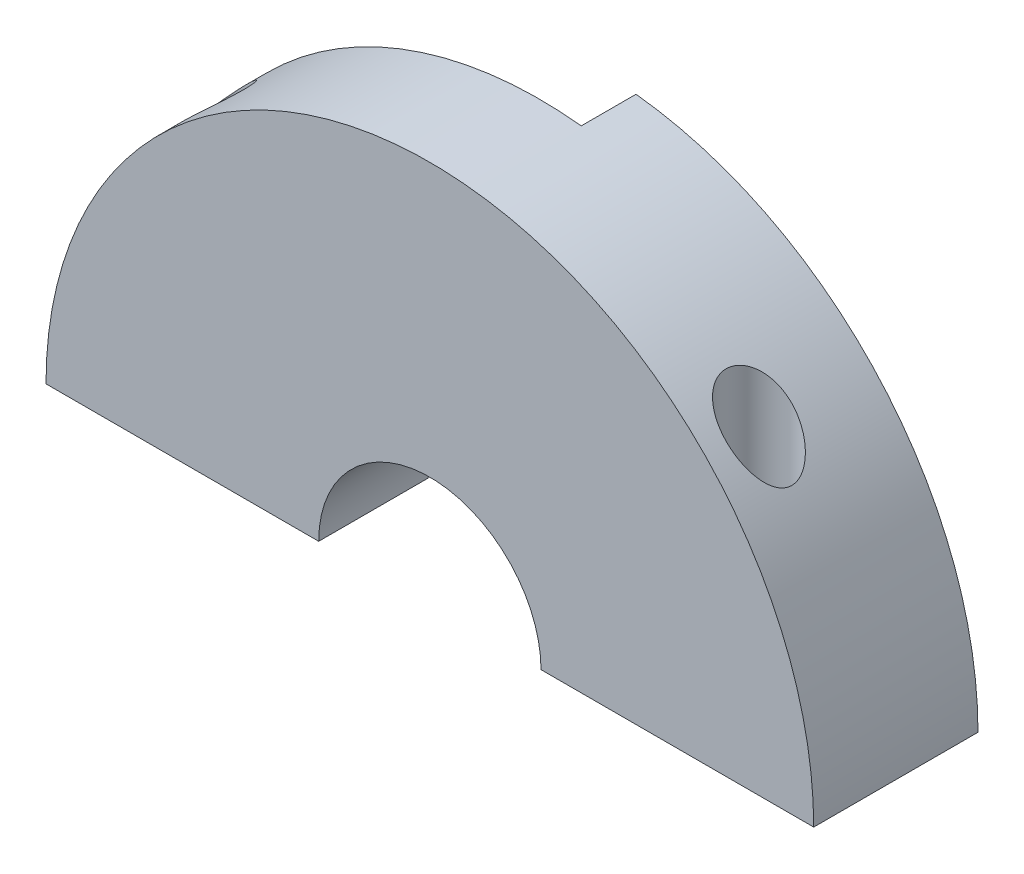
ISO-10303-21;
HEADER;
FILE_DESCRIPTION(('STEP AP214'),'2;1');
FILE_NAME('part.step','',(''),(''),'','','');
FILE_SCHEMA(('AUTOMOTIVE_DESIGN { 1 0 10303 214 1 1 1 1 }'));
ENDSEC;
DATA;
#1=APPLICATION_CONTEXT('core data for automotive mechanical design processes');
#2=APPLICATION_PROTOCOL_DEFINITION('international standard','automotive_design',2000,#1);
#3=PRODUCT_CONTEXT('',#1,'mechanical');
#4=PRODUCT('Part','Part','',(#3));
#5=PRODUCT_RELATED_PRODUCT_CATEGORY('part','',(#4));
#6=PRODUCT_DEFINITION_FORMATION('','',#4);
#7=PRODUCT_DEFINITION_CONTEXT('part definition',#1,'design');
#8=PRODUCT_DEFINITION('design','',#6,#7);
#9=PRODUCT_DEFINITION_SHAPE('','',#8);
#10=(LENGTH_UNIT() NAMED_UNIT(*) SI_UNIT(.MILLI.,.METRE.));
#11=(NAMED_UNIT(*) PLANE_ANGLE_UNIT() SI_UNIT($,.RADIAN.));
#12=(NAMED_UNIT(*) SI_UNIT($,.STERADIAN.) SOLID_ANGLE_UNIT());
#13=UNCERTAINTY_MEASURE_WITH_UNIT(LENGTH_MEASURE(1.E-05),#10,'distance_accuracy_value','');
#14=(GEOMETRIC_REPRESENTATION_CONTEXT(3) GLOBAL_UNCERTAINTY_ASSIGNED_CONTEXT((#13)) GLOBAL_UNIT_ASSIGNED_CONTEXT((#10,
#11,#12)) REPRESENTATION_CONTEXT('',''));
#15=CARTESIAN_POINT('',(0.,0.,0.));
#16=DIRECTION('',(0.,0.,1.));
#17=DIRECTION('',(1.,0.,0.));
#18=AXIS2_PLACEMENT_3D('',#15,#16,#17);
#19=CARTESIAN_POINT('',(0.,0.,-5.));
#20=DIRECTION('',(0.,0.,-1.));
#21=DIRECTION('',(-1.,0.,0.));
#22=AXIS2_PLACEMENT_3D('',#19,#20,#21);
#23=PLANE('',#22);
#24=DIRECTION('',(0.,1.,0.));
#25=VECTOR('',#24,1.);
#26=CARTESIAN_POINT('',(3.825,10.15,-5.));
#27=LINE('',#26,#25);
#28=CARTESIAN_POINT('',(3.825,11.9003939010438,-5.));
#29=VERTEX_POINT('',#28);
#30=CARTESIAN_POINT('',(3.825,34.8406641010185,-5.));
#31=VERTEX_POINT('',#30);
#32=EDGE_CURVE('E256',#29,#31,#27,.T.);
#33=ORIENTED_EDGE('',*,*,#32,.F.);
#34=CARTESIAN_POINT('',(0.,0.,-5.));
#35=DIRECTION('',(0.,0.,-1.));
#36=DIRECTION('',(-1.,0.,0.));
#37=AXIS2_PLACEMENT_3D('',#34,#35,#36);
#38=CIRCLE('',#37,12.5);
#39=CARTESIAN_POINT('',(12.5,0.,-5.));
#40=VERTEX_POINT('',#39);
#41=EDGE_CURVE('E191',#29,#40,#38,.T.);
#42=ORIENTED_EDGE('',*,*,#41,.T.);
#43=DIRECTION('',(1.,0.,0.));
#44=VECTOR('',#43,1.);
#45=CARTESIAN_POINT('',(10.15,0.,-5.));
#46=LINE('',#45,#44);
#47=CARTESIAN_POINT('',(10.15,0.,-5.));
#48=VERTEX_POINT('',#47);
#49=EDGE_CURVE('E175',#48,#40,#46,.T.);
#50=ORIENTED_EDGE('',*,*,#49,.F.);
#51=CARTESIAN_POINT('',(0.,0.,-5.));
#52=DIRECTION('',(0.,0.,-1.));
#53=DIRECTION('',(-1.,0.,0.));
#54=AXIS2_PLACEMENT_3D('',#51,#52,#53);
#55=CIRCLE('',#54,10.15);
#56=CARTESIAN_POINT('',(-10.15,0.,-5.));
#57=VERTEX_POINT('',#56);
#58=EDGE_CURVE('E173',#57,#48,#55,.T.);
#59=ORIENTED_EDGE('',*,*,#58,.F.);
#60=DIRECTION('',(1.,0.,0.));
#61=VECTOR('',#60,1.);
#62=CARTESIAN_POINT('',(-35.05,0.,-5.));
#63=LINE('',#62,#61);
#64=CARTESIAN_POINT('',(-35.05,0.,-5.));
#65=VERTEX_POINT('',#64);
#66=EDGE_CURVE('E79',#65,#57,#63,.T.);
#67=ORIENTED_EDGE('',*,*,#66,.F.);
#68=CARTESIAN_POINT('',(0.,0.,-5.));
#69=DIRECTION('',(0.,0.,1.));
#70=DIRECTION('',(-1.,0.,0.));
#71=AXIS2_PLACEMENT_3D('',#68,#69,#70);
#72=CIRCLE('',#71,35.05);
#73=EDGE_CURVE('E184',#31,#65,#72,.T.);
#74=ORIENTED_EDGE('',*,*,#73,.F.);
#75=EDGE_LOOP('',(#33,#42,#50,#59,#67,#74));
#76=FACE_BOUND('',#75,.T.);
#77=ADVANCED_FACE('F39',(#76),#23,.T.);
#78=CARTESIAN_POINT('',(0.,0.,5.));
#79=DIRECTION('',(0.,0.,-1.));
#80=DIRECTION('',(-1.,0.,0.));
#81=AXIS2_PLACEMENT_3D('',#78,#79,#80);
#82=CYLINDRICAL_SURFACE('',#81,35.05);
#83=CARTESIAN_POINT('',(-25.05,24.5153013442625,-3.));
#84=CARTESIAN_POINT('',(-25.172757891254,24.3898663526324,-3.00000044484929));
#85=CARTESIAN_POINT('',(-25.2945625994032,24.2635156000176,-2.99247561534126));
#86=CARTESIAN_POINT('',(-25.5354877242666,24.0098309185247,-2.96294431357934));
#87=CARTESIAN_POINT('',(-25.6546066663492,23.8824964987061,-2.94093007691785));
#88=CARTESIAN_POINT('',(-25.8895822909666,23.6275717488237,-2.88267004067348));
#89=CARTESIAN_POINT('',(-26.005431624629,23.4999814408841,-2.84639455408118));
#90=CARTESIAN_POINT('',(-26.2328335992969,23.2458595122369,-2.75965769624504));
#91=CARTESIAN_POINT('',(-26.3443879560941,23.1193274849091,-2.70920205808389));
#92=CARTESIAN_POINT('',(-26.5351618997156,22.8998523921002,-2.60822728166251));
#93=CARTESIAN_POINT('',(-26.6154974492892,22.8064147449125,-2.5608727273555));
#94=CARTESIAN_POINT('',(-26.7728837478198,22.6214484357102,-2.45774751161039));
#95=CARTESIAN_POINT('',(-26.8499351951018,22.5299193699943,-2.40197865093966));
#96=CARTESIAN_POINT('',(-27.0000897695027,22.3497509875131,-2.28174986367317));
#97=CARTESIAN_POINT('',(-27.0732010371271,22.2611058755066,-2.21730889989038));
#98=CARTESIAN_POINT('',(-27.2149351571089,22.0876062654062,-2.07914489657723));
#99=CARTESIAN_POINT('',(-27.283560218317,22.0027499084868,-2.00542647804461));
#100=CARTESIAN_POINT('',(-27.4314674780003,21.8182083097646,-1.82891166076218));
#101=CARTESIAN_POINT('',(-27.5092997468093,21.719915638351,-1.72339857306034));
#102=CARTESIAN_POINT('',(-27.6540776902447,21.5352781518383,-1.49563995161742));
#103=CARTESIAN_POINT('',(-27.7210366171384,21.448918812011,-1.37341512586096));
#104=CARTESIAN_POINT('',(-27.8259424466231,21.3125549168893,-1.14285358057722));
#105=CARTESIAN_POINT('',(-27.8669980884483,21.2587951142391,-1.0381847526666));
#106=CARTESIAN_POINT('',(-27.9382255514892,21.1651016240705,-0.819346778024123));
#107=CARTESIAN_POINT('',(-27.9684140166209,21.1251467969754,-0.705192491936466));
#108=CARTESIAN_POINT('',(-28.0116879450171,21.0677224809023,-0.488445951736061));
#109=CARTESIAN_POINT('',(-28.0267410135345,21.0476730341209,-0.386939432738642));
#110=CARTESIAN_POINT('',(-28.0463050481677,21.0215972869105,-0.181145749388428));
#111=CARTESIAN_POINT('',(-28.0508229793721,21.0155617215044,-0.0768604683166422));
#112=CARTESIAN_POINT('',(-28.0489281663807,21.0180905274009,0.131506570301793));
#113=CARTESIAN_POINT('',(-28.0425072108911,21.026665866404,0.23558811619158));
#114=CARTESIAN_POINT('',(-28.0192814263249,21.0576050075944,0.440486055856502));
#115=CARTESIAN_POINT('',(-28.0024689820485,21.0799789217716,0.541299997958127));
#116=CARTESIAN_POINT('',(-27.9543405118352,21.1437767220432,0.761930286264053));
#117=CARTESIAN_POINT('',(-27.9204506240969,21.1885631119406,0.880202822433532));
#118=CARTESIAN_POINT('',(-27.8412377985411,21.2925397959152,1.10607118947644));
#119=CARTESIAN_POINT('',(-27.7958938354049,21.3517565715488,1.21364687332488));
#120=CARTESIAN_POINT('',(-27.6731235877679,21.5108083212011,1.46524579576032));
#121=CARTESIAN_POINT('',(-27.5905930726705,21.6167129315,1.60289654223807));
#122=CARTESIAN_POINT('',(-27.4120550044548,21.8426785160984,1.85601110970815));
#123=CARTESIAN_POINT('',(-27.3160166352573,21.962771756424,1.9714227273624));
#124=CARTESIAN_POINT('',(-27.1373386927273,22.1829350102184,2.15767609782985));
#125=CARTESIAN_POINT('',(-27.0567297040771,22.2812209451849,2.23265472658813));
#126=CARTESIAN_POINT('',(-26.8905690672117,22.4814750781682,2.37150558514877));
#127=CARTESIAN_POINT('',(-26.8050148722535,22.5834451631744,2.43537202313208));
#128=CARTESIAN_POINT('',(-26.6296941242675,22.7899156830797,2.55258506461304));
#129=CARTESIAN_POINT('',(-26.5399241665245,22.8944181290062,2.60592297774579));
#130=CARTESIAN_POINT('',(-26.3568356067813,23.1049601872613,2.70238511156922));
#131=CARTESIAN_POINT('',(-26.2635175754239,23.2109995507214,2.74551096668547));
#132=CARTESIAN_POINT('',(-26.0701167400421,23.4280479107295,2.82323154750622));
#133=CARTESIAN_POINT('',(-25.9699119228552,23.5390902633247,2.85743096318294));
#134=CARTESIAN_POINT('',(-25.7667060073064,23.761357569237,2.91504526035658));
#135=CARTESIAN_POINT('',(-25.6637046862478,23.8725825364298,2.93845928028639));
#136=CARTESIAN_POINT('',(-25.3512257370835,24.2055779349429,2.99231335044384));
#137=CARTESIAN_POINT('',(-25.1380556577606,24.4269133966725,3.00645246376579));
#138=CARTESIAN_POINT('',(-24.822027905311,24.7465170197171,2.99301842739194));
#139=CARTESIAN_POINT('',(-24.7208792551347,24.8475529564468,2.983648890412));
#140=CARTESIAN_POINT('',(-24.518153550358,25.0476136268905,2.95425776847888));
#141=CARTESIAN_POINT('',(-24.4165765022813,25.1466383910979,2.9342363451552));
#142=CARTESIAN_POINT('',(-24.1123880854785,25.4396126273706,2.85737174682403));
#143=CARTESIAN_POINT('',(-23.9099389699068,25.6298463115961,2.78371647760887));
#144=CARTESIAN_POINT('',(-23.5656018323095,25.9461911629145,2.61216007064956));
#145=CARTESIAN_POINT('',(-23.4216123041758,26.076146410766,2.52548416767023));
#146=CARTESIAN_POINT('',(-23.1435495745059,26.3232400341172,2.32270309053491));
#147=CARTESIAN_POINT('',(-23.0094633145827,26.440395388894,2.20663759767674));
#148=CARTESIAN_POINT('',(-22.7841621943713,26.6345986832324,1.97146867589776));
#149=CARTESIAN_POINT('',(-22.68984034258,26.7149142244425,1.85805477353272));
#150=CARTESIAN_POINT('',(-22.5157912520378,26.8617679443251,1.61255872624921));
#151=CARTESIAN_POINT('',(-22.4360483213487,26.9283209464671,1.48049692759225));
#152=CARTESIAN_POINT('',(-22.3064990722413,27.0356913859002,1.22103351295826));
#153=CARTESIAN_POINT('',(-22.2539850297082,27.0788827369731,1.09597308440249));
#154=CARTESIAN_POINT('',(-22.165641317568,27.1512453763183,0.836216138957166));
#155=CARTESIAN_POINT('',(-22.1298044340749,27.1804227266742,0.701523817588893));
#156=CARTESIAN_POINT('',(-22.0769865424321,27.2233421414251,0.425457845629025));
#157=CARTESIAN_POINT('',(-22.060084801884,27.2370193206796,0.284058671566581));
#158=CARTESIAN_POINT('',(-22.0466272439387,27.2479139407458,-0.000334325691453706));
#159=CARTESIAN_POINT('',(-22.0500672799567,27.2451347361214,-0.143327817960635));
#160=CARTESIAN_POINT('',(-22.0760256919843,27.2241036053428,-0.415723812438318));
#161=CARTESIAN_POINT('',(-22.0971301676013,27.2069983090852,-0.545355381237512));
#162=CARTESIAN_POINT('',(-22.1552898960293,27.1596580030133,-0.798448506500745));
#163=CARTESIAN_POINT('',(-22.1923456568636,27.1294225750247,-0.921909866313538));
#164=CARTESIAN_POINT('',(-22.2819975351572,27.0558411016933,-1.16423640349877));
#165=CARTESIAN_POINT('',(-22.335098786792,27.0120676053565,-1.28278266786115));
#166=CARTESIAN_POINT('',(-22.4537131756449,26.9135508241961,-1.50850407135077));
#167=CARTESIAN_POINT('',(-22.5192323932145,26.8588021647164,-1.61567359968254));
#168=CARTESIAN_POINT('',(-22.6883184050767,26.7162726060029,-1.85799066531246));
#169=CARTESIAN_POINT('',(-22.7966307176937,26.6240314331644,-1.98722079169691));
#170=CARTESIAN_POINT('',(-23.0264516856196,26.4255220007234,-2.22086384537533));
#171=CARTESIAN_POINT('',(-23.1479875878421,26.3192246779073,-2.32522406226156));
#172=CARTESIAN_POINT('',(-23.4395550308243,26.0602909676363,-2.53945843415879));
#173=CARTESIAN_POINT('',(-23.6126467064517,25.9037206998967,-2.64038299018162));
#174=CARTESIAN_POINT('',(-23.9648464775664,25.5782386879674,-2.80360079020092));
#175=CARTESIAN_POINT('',(-24.1439559103007,25.4093241907506,-2.86588538709015));
#176=CARTESIAN_POINT('',(-24.4449362613819,25.1192406594188,-2.94101746498194));
#177=CARTESIAN_POINT('',(-24.566656285179,25.0002227798378,-2.96332752951457));
#178=CARTESIAN_POINT('',(-24.8092206315748,24.7595278096734,-2.99281600201525));
#179=CARTESIAN_POINT('',(-24.9300652385342,24.6378516393754,-2.99999956538115));
#180=CARTESIAN_POINT('',(-25.05,24.5153013442625,-3.));
#181=B_SPLINE_CURVE_WITH_KNOTS('',3,(#83,#84,#85,#86,#87,#88,#89,#90,#91,#92,#93,#94,#95,#96,
#97,#98,#99,#100,#101,#102,#103,#104,#105,#106,#107,#108,#109,#110,#111,#112,#113,#114,#115,
#116,#117,#118,#119,#120,#121,#122,#123,#124,#125,#126,#127,#128,#129,#130,#131,#132,#133,#134,
#135,#136,#137,#138,#139,#140,#141,#142,#143,#144,#145,#146,#147,#148,#149,#150,#151,#152,#153,
#154,#155,#156,#157,#158,#159,#160,#161,#162,#163,#164,#165,#166,#167,#168,#169,#170,#171,#172,
#173,#174,#175,#176,#177,#178,#179,#180),.UNSPECIFIED.,.T.,.F.,(4,2,2,2,2,2,2,2,2,2,2,2,2,2,2,2,
2,2,2,2,2,2,2,2,2,2,2,2,2,2,2,2,2,2,2,2,2,2,2,2,2,2,2,2,2,2,2,2,4),(0.,0.526355337446213,
1.052992961692,1.58073271873458,2.10825941501928,2.50400393520796,2.89966388091259,
3.29447230582238,3.68908485359681,4.17936831883324,4.66904967474562,5.04163624119242,
5.41364971011258,5.72594317846209,6.03803012182269,6.35035143701256,6.66290190259589,
7.05352564643377,7.44487170441837,8.01856262304741,8.59358422259627,9.03575721031553,
9.47815997844202,9.92092639778951,10.3636219050233,10.8234708414128,11.2833565054337,
12.2021206998416,12.6316061939877,13.0610851713961,13.9184370141058,14.5536703548092,
15.1880505460035,15.6900331679196,16.1914722612149,16.6167155160183,17.0417746558719,
17.4686066349088,17.8953516090604,18.2908820962119,18.6864251813199,19.096014673896,
19.5058052390343,20.0792384624802,20.6538764470756,21.4126569619937,22.1716072206707,
22.6860330334643,23.2002834918093),.UNSPECIFIED.);
#182=CARTESIAN_POINT('',(-25.05,24.5153013442625,-3.));
#183=VERTEX_POINT('',#182);
#184=EDGE_CURVE('E134',#183,#183,#181,.T.);
#185=ORIENTED_EDGE('',*,*,#184,.F.);
#186=EDGE_LOOP('',(#185));
#187=FACE_BOUND('',#186,.T.);
#188=CARTESIAN_POINT('',(25.05,24.5153013442625,-3.));
#189=CARTESIAN_POINT('',(25.172757891254,24.3898663526324,-3.00000044484929));
#190=CARTESIAN_POINT('',(25.2945625994032,24.2635156000176,-2.99247561534126));
#191=CARTESIAN_POINT('',(25.5354877242666,24.0098309185247,-2.96294431357934));
#192=CARTESIAN_POINT('',(25.6546066663492,23.8824964987061,-2.94093007691785));
#193=CARTESIAN_POINT('',(25.8895822909666,23.6275717488237,-2.88267004067348));
#194=CARTESIAN_POINT('',(26.005431624629,23.4999814408841,-2.84639455408118));
#195=CARTESIAN_POINT('',(26.2328335992969,23.2458595122369,-2.75965769624504));
#196=CARTESIAN_POINT('',(26.3443879560941,23.1193274849091,-2.70920205808389));
#197=CARTESIAN_POINT('',(26.5351618997156,22.8998523921002,-2.60822728166251));
#198=CARTESIAN_POINT('',(26.6154974492892,22.8064147449125,-2.5608727273555));
#199=CARTESIAN_POINT('',(26.7728837478198,22.6214484357102,-2.45774751161039));
#200=CARTESIAN_POINT('',(26.8499351951018,22.5299193699943,-2.40197865093966));
#201=CARTESIAN_POINT('',(27.0000897695027,22.3497509875131,-2.28174986367317));
#202=CARTESIAN_POINT('',(27.0732010371271,22.2611058755066,-2.21730889989038));
#203=CARTESIAN_POINT('',(27.2149351571089,22.0876062654062,-2.07914489657723));
#204=CARTESIAN_POINT('',(27.283560218317,22.0027499084868,-2.00542647804461));
#205=CARTESIAN_POINT('',(27.4314674780003,21.8182083097646,-1.82891166076218));
#206=CARTESIAN_POINT('',(27.5092997468093,21.719915638351,-1.72339857306034));
#207=CARTESIAN_POINT('',(27.6540776902447,21.5352781518383,-1.49563995161742));
#208=CARTESIAN_POINT('',(27.7210366171384,21.448918812011,-1.37341512586096));
#209=CARTESIAN_POINT('',(27.8259424466231,21.3125549168893,-1.14285358057722));
#210=CARTESIAN_POINT('',(27.8669980884483,21.2587951142391,-1.0381847526666));
#211=CARTESIAN_POINT('',(27.9382255514892,21.1651016240705,-0.819346778024123));
#212=CARTESIAN_POINT('',(27.9684140166209,21.1251467969754,-0.705192491936466));
#213=CARTESIAN_POINT('',(28.0116879450171,21.0677224809023,-0.488445951736061));
#214=CARTESIAN_POINT('',(28.0267410135345,21.0476730341209,-0.386939432738642));
#215=CARTESIAN_POINT('',(28.0463050481677,21.0215972869105,-0.181145749388428));
#216=CARTESIAN_POINT('',(28.0508229793721,21.0155617215044,-0.0768604683166422));
#217=CARTESIAN_POINT('',(28.0489281663807,21.0180905274009,0.131506570301793));
#218=CARTESIAN_POINT('',(28.0425072108911,21.026665866404,0.23558811619158));
#219=CARTESIAN_POINT('',(28.0192814263249,21.0576050075944,0.440486055856502));
#220=CARTESIAN_POINT('',(28.0024689820485,21.0799789217716,0.541299997958127));
#221=CARTESIAN_POINT('',(27.9543405118352,21.1437767220432,0.761930286264053));
#222=CARTESIAN_POINT('',(27.9204506240969,21.1885631119406,0.880202822433532));
#223=CARTESIAN_POINT('',(27.8412377985411,21.2925397959152,1.10607118947644));
#224=CARTESIAN_POINT('',(27.7958938354049,21.3517565715488,1.21364687332488));
#225=CARTESIAN_POINT('',(27.6731235877679,21.5108083212011,1.46524579576032));
#226=CARTESIAN_POINT('',(27.5905930726705,21.6167129315,1.60289654223807));
#227=CARTESIAN_POINT('',(27.4120550044548,21.8426785160984,1.85601110970815));
#228=CARTESIAN_POINT('',(27.3160166352573,21.962771756424,1.9714227273624));
#229=CARTESIAN_POINT('',(27.1373386927273,22.1829350102184,2.15767609782985));
#230=CARTESIAN_POINT('',(27.0567297040771,22.2812209451849,2.23265472658813));
#231=CARTESIAN_POINT('',(26.8905690672117,22.4814750781682,2.37150558514877));
#232=CARTESIAN_POINT('',(26.8050148722535,22.5834451631744,2.43537202313208));
#233=CARTESIAN_POINT('',(26.6296941242675,22.7899156830797,2.55258506461304));
#234=CARTESIAN_POINT('',(26.5399241665245,22.8944181290062,2.60592297774579));
#235=CARTESIAN_POINT('',(26.3568356067813,23.1049601872613,2.70238511156922));
#236=CARTESIAN_POINT('',(26.2635175754239,23.2109995507214,2.74551096668547));
#237=CARTESIAN_POINT('',(26.0701167400421,23.4280479107295,2.82323154750622));
#238=CARTESIAN_POINT('',(25.9699119228552,23.5390902633247,2.85743096318294));
#239=CARTESIAN_POINT('',(25.7667060073064,23.761357569237,2.91504526035658));
#240=CARTESIAN_POINT('',(25.6637046862478,23.8725825364298,2.93845928028639));
#241=CARTESIAN_POINT('',(25.3512257370835,24.2055779349429,2.99231335044384));
#242=CARTESIAN_POINT('',(25.1380556577606,24.4269133966725,3.00645246376579));
#243=CARTESIAN_POINT('',(24.822027905311,24.7465170197171,2.99301842739194));
#244=CARTESIAN_POINT('',(24.7208792551347,24.8475529564468,2.983648890412));
#245=CARTESIAN_POINT('',(24.518153550358,25.0476136268905,2.95425776847888));
#246=CARTESIAN_POINT('',(24.4165765022813,25.1466383910979,2.9342363451552));
#247=CARTESIAN_POINT('',(24.1123880854785,25.4396126273706,2.85737174682403));
#248=CARTESIAN_POINT('',(23.9099389699068,25.6298463115961,2.78371647760887));
#249=CARTESIAN_POINT('',(23.5656018323095,25.9461911629145,2.61216007064956));
#250=CARTESIAN_POINT('',(23.4216123041758,26.076146410766,2.52548416767023));
#251=CARTESIAN_POINT('',(23.1435495745059,26.3232400341172,2.32270309053491));
#252=CARTESIAN_POINT('',(23.0094633145827,26.440395388894,2.20663759767674));
#253=CARTESIAN_POINT('',(22.7841621943713,26.6345986832324,1.97146867589776));
#254=CARTESIAN_POINT('',(22.68984034258,26.7149142244425,1.85805477353272));
#255=CARTESIAN_POINT('',(22.5157912520378,26.8617679443251,1.61255872624921));
#256=CARTESIAN_POINT('',(22.4360483213487,26.9283209464671,1.48049692759225));
#257=CARTESIAN_POINT('',(22.3064990722413,27.0356913859002,1.22103351295826));
#258=CARTESIAN_POINT('',(22.2539850297082,27.0788827369731,1.09597308440249));
#259=CARTESIAN_POINT('',(22.165641317568,27.1512453763183,0.836216138957166));
#260=CARTESIAN_POINT('',(22.1298044340749,27.1804227266742,0.701523817588893));
#261=CARTESIAN_POINT('',(22.0769865424321,27.2233421414251,0.425457845629025));
#262=CARTESIAN_POINT('',(22.060084801884,27.2370193206796,0.284058671566581));
#263=CARTESIAN_POINT('',(22.0466272439387,27.2479139407458,-0.000334325691453706));
#264=CARTESIAN_POINT('',(22.0500672799567,27.2451347361214,-0.143327817960635));
#265=CARTESIAN_POINT('',(22.0760256919843,27.2241036053428,-0.415723812438318));
#266=CARTESIAN_POINT('',(22.0971301676013,27.2069983090852,-0.545355381237512));
#267=CARTESIAN_POINT('',(22.1552898960293,27.1596580030133,-0.798448506500745));
#268=CARTESIAN_POINT('',(22.1923456568636,27.1294225750247,-0.921909866313538));
#269=CARTESIAN_POINT('',(22.2819975351572,27.0558411016933,-1.16423640349877));
#270=CARTESIAN_POINT('',(22.335098786792,27.0120676053565,-1.28278266786115));
#271=CARTESIAN_POINT('',(22.4537131756449,26.9135508241961,-1.50850407135077));
#272=CARTESIAN_POINT('',(22.5192323932145,26.8588021647164,-1.61567359968254));
#273=CARTESIAN_POINT('',(22.6883184050767,26.7162726060029,-1.85799066531246));
#274=CARTESIAN_POINT('',(22.7966307176937,26.6240314331644,-1.98722079169691));
#275=CARTESIAN_POINT('',(23.0264516856196,26.4255220007234,-2.22086384537533));
#276=CARTESIAN_POINT('',(23.1479875878421,26.3192246779073,-2.32522406226156));
#277=CARTESIAN_POINT('',(23.4395550308243,26.0602909676363,-2.53945843415879));
#278=CARTESIAN_POINT('',(23.6126467064517,25.9037206998967,-2.64038299018162));
#279=CARTESIAN_POINT('',(23.9648464775664,25.5782386879674,-2.80360079020092));
#280=CARTESIAN_POINT('',(24.1439559103007,25.4093241907506,-2.86588538709015));
#281=CARTESIAN_POINT('',(24.4449362613819,25.1192406594188,-2.94101746498194));
#282=CARTESIAN_POINT('',(24.566656285179,25.0002227798378,-2.96332752951457));
#283=CARTESIAN_POINT('',(24.8092206315748,24.7595278096734,-2.99281600201525));
#284=CARTESIAN_POINT('',(24.9300652385342,24.6378516393754,-2.99999956538115));
#285=CARTESIAN_POINT('',(25.05,24.5153013442625,-3.));
#286=B_SPLINE_CURVE_WITH_KNOTS('',3,(#188,#189,#190,#191,#192,#193,#194,#195,#196,#197,#198,
#199,#200,#201,#202,#203,#204,#205,#206,#207,#208,#209,#210,#211,#212,#213,#214,#215,#216,#217,
#218,#219,#220,#221,#222,#223,#224,#225,#226,#227,#228,#229,#230,#231,#232,#233,#234,#235,#236,
#237,#238,#239,#240,#241,#242,#243,#244,#245,#246,#247,#248,#249,#250,#251,#252,#253,#254,#255,
#256,#257,#258,#259,#260,#261,#262,#263,#264,#265,#266,#267,#268,#269,#270,#271,#272,#273,#274,
#275,#276,#277,#278,#279,#280,#281,#282,#283,#284,#285),.UNSPECIFIED.,.T.,.F.,(4,2,2,2,2,2,2,2,
2,2,2,2,2,2,2,2,2,2,2,2,2,2,2,2,2,2,2,2,2,2,2,2,2,2,2,2,2,2,2,2,2,2,2,2,2,2,2,2,4),(0.,
0.526355337446213,1.052992961692,1.58073271873458,2.10825941501928,2.50400393520796,
2.89966388091259,3.29447230582238,3.68908485359681,4.17936831883324,4.66904967474562,
5.04163624119242,5.41364971011258,5.72594317846209,6.03803012182269,6.35035143701256,
6.66290190259589,7.05352564643377,7.44487170441837,8.01856262304741,8.59358422259627,
9.03575721031553,9.47815997844202,9.92092639778951,10.3636219050233,10.8234708414128,
11.2833565054337,12.2021206998416,12.6316061939877,13.0610851713961,13.9184370141058,
14.5536703548092,15.1880505460035,15.6900331679196,16.1914722612149,16.6167155160183,
17.0417746558719,17.4686066349088,17.8953516090604,18.2908820962119,18.6864251813199,
19.096014673896,19.5058052390343,20.0792384624802,20.6538764470756,21.4126569619937,
22.1716072206707,22.6860330334643,23.2002834918093),.UNSPECIFIED.);
#287=CARTESIAN_POINT('',(25.05,24.5153013442625,-3.));
#288=VERTEX_POINT('',#287);
#289=EDGE_CURVE('E210',#288,#288,#286,.T.);
#290=ORIENTED_EDGE('',*,*,#289,.T.);
#291=EDGE_LOOP('',(#290));
#292=FACE_BOUND('',#291,.T.);
#293=CARTESIAN_POINT('',(0.,0.,5.));
#294=DIRECTION('',(0.,0.,1.));
#295=DIRECTION('',(-1.,0.,0.));
#296=AXIS2_PLACEMENT_3D('',#293,#294,#295);
#297=CIRCLE('',#296,35.05);
#298=CARTESIAN_POINT('',(35.05,0.,5.));
#299=VERTEX_POINT('',#298);
#300=CARTESIAN_POINT('',(-35.05,0.,5.));
#301=VERTEX_POINT('',#300);
#302=EDGE_CURVE('E106',#299,#301,#297,.T.);
#303=ORIENTED_EDGE('',*,*,#302,.F.);
#304=DIRECTION('',(0.,0.,-1.));
#305=VECTOR('',#304,1.);
#306=CARTESIAN_POINT('',(35.05,0.,5.));
#307=LINE('',#306,#305);
#308=CARTESIAN_POINT('',(35.05,0.,-10.));
#309=VERTEX_POINT('',#308);
#310=EDGE_CURVE('E116',#299,#309,#307,.T.);
#311=ORIENTED_EDGE('',*,*,#310,.T.);
#312=CARTESIAN_POINT('',(0.,0.,-10.));
#313=DIRECTION('',(0.,0.,1.));
#314=DIRECTION('',(1.,0.,0.));
#315=AXIS2_PLACEMENT_3D('',#312,#313,#314);
#316=CIRCLE('',#315,35.05);
#317=CARTESIAN_POINT('',(3.825,34.8406641010185,-10.));
#318=VERTEX_POINT('',#317);
#319=EDGE_CURVE('E201',#309,#318,#316,.T.);
#320=ORIENTED_EDGE('',*,*,#319,.T.);
#321=DIRECTION('',(0.,0.,-1.));
#322=VECTOR('',#321,1.);
#323=CARTESIAN_POINT('',(3.825,34.8406641010185,5.));
#324=LINE('',#323,#322);
#325=EDGE_CURVE('E54',#318,#31,#324,.F.);
#326=ORIENTED_EDGE('',*,*,#325,.T.);
#327=ORIENTED_EDGE('',*,*,#73,.T.);
#328=DIRECTION('',(0.,0.,-1.));
#329=VECTOR('',#328,1.);
#330=CARTESIAN_POINT('',(-35.05,0.,5.));
#331=LINE('',#330,#329);
#332=EDGE_CURVE('E118',#301,#65,#331,.T.);
#333=ORIENTED_EDGE('',*,*,#332,.F.);
#334=EDGE_LOOP('',(#303,#311,#320,#326,#327,#333));
#335=FACE_BOUND('',#334,.T.);
#336=ADVANCED_FACE('F114',(#187,#292,#335),#82,.T.);
#337=CARTESIAN_POINT('',(0.,0.,5.));
#338=DIRECTION('',(0.,0.,-1.));
#339=DIRECTION('',(-1.,0.,0.));
#340=AXIS2_PLACEMENT_3D('',#337,#338,#339);
#341=PLANE('',#340);
#342=DIRECTION('',(1.,0.,0.));
#343=VECTOR('',#342,1.);
#344=CARTESIAN_POINT('',(10.15,0.,5.));
#345=LINE('',#344,#343);
#346=CARTESIAN_POINT('',(10.15,0.,5.));
#347=VERTEX_POINT('',#346);
#348=EDGE_CURVE('E103',#347,#299,#345,.T.);
#349=ORIENTED_EDGE('',*,*,#348,.T.);
#350=ORIENTED_EDGE('',*,*,#302,.T.);
#351=DIRECTION('',(1.,0.,0.));
#352=VECTOR('',#351,1.);
#353=CARTESIAN_POINT('',(-35.05,0.,5.));
#354=LINE('',#353,#352);
#355=CARTESIAN_POINT('',(-10.15,0.,5.));
#356=VERTEX_POINT('',#355);
#357=EDGE_CURVE('E62',#301,#356,#354,.T.);
#358=ORIENTED_EDGE('',*,*,#357,.T.);
#359=CARTESIAN_POINT('',(0.,0.,5.));
#360=DIRECTION('',(0.,0.,-1.));
#361=DIRECTION('',(-1.,0.,0.));
#362=AXIS2_PLACEMENT_3D('',#359,#360,#361);
#363=CIRCLE('',#362,10.15);
#364=EDGE_CURVE('E83',#356,#347,#363,.T.);
#365=ORIENTED_EDGE('',*,*,#364,.T.);
#366=EDGE_LOOP('',(#349,#350,#358,#365));
#367=FACE_BOUND('',#366,.T.);
#368=ADVANCED_FACE('F105',(#367),#341,.F.);
#369=CARTESIAN_POINT('',(25.05,35.05,0.));
#370=DIRECTION('',(0.,-1.,0.));
#371=DIRECTION('',(0.,0.,-1.));
#372=AXIS2_PLACEMENT_3D('',#369,#370,#371);
#373=CYLINDRICAL_SURFACE('',#372,1.7);
#374=CARTESIAN_POINT('',(25.05,0.,0.));
#375=DIRECTION('',(0.,-1.,0.));
#376=DIRECTION('',(0.,0.,1.));
#377=AXIS2_PLACEMENT_3D('',#374,#375,#376);
#378=CIRCLE('',#377,1.7);
#379=CARTESIAN_POINT('',(25.05,0.,1.7));
#380=VERTEX_POINT('',#379);
#381=EDGE_CURVE('E208',#380,#380,#378,.T.);
#382=ORIENTED_EDGE('',*,*,#381,.T.);
#383=EDGE_LOOP('',(#382));
#384=FACE_BOUND('',#383,.T.);
#385=CARTESIAN_POINT('',(25.05,2.,0.));
#386=DIRECTION('',(0.,1.,0.));
#387=DIRECTION('',(0.,0.,1.));
#388=AXIS2_PLACEMENT_3D('',#385,#386,#387);
#389=CIRCLE('',#388,1.7);
#390=CARTESIAN_POINT('',(25.05,2.,1.7));
#391=VERTEX_POINT('',#390);
#392=EDGE_CURVE('E144',#391,#391,#389,.F.);
#393=ORIENTED_EDGE('',*,*,#392,.F.);
#394=EDGE_LOOP('',(#393));
#395=FACE_BOUND('',#394,.T.);
#396=ADVANCED_FACE('F159',(#384,#395),#373,.F.);
#397=CARTESIAN_POINT('',(-25.05,35.05,0.));
#398=DIRECTION('',(0.,-1.,0.));
#399=DIRECTION('',(0.,0.,-1.));
#400=AXIS2_PLACEMENT_3D('',#397,#398,#399);
#401=CYLINDRICAL_SURFACE('',#400,1.7);
#402=CARTESIAN_POINT('',(-25.05,0.,0.));
#403=DIRECTION('',(0.,1.,0.));
#404=DIRECTION('',(0.,0.,1.));
#405=AXIS2_PLACEMENT_3D('',#402,#403,#404);
#406=CIRCLE('',#405,1.7);
#407=CARTESIAN_POINT('',(-25.05,0.,1.7));
#408=VERTEX_POINT('',#407);
#409=EDGE_CURVE('E143',#408,#408,#406,.T.);
#410=ORIENTED_EDGE('',*,*,#409,.F.);
#411=EDGE_LOOP('',(#410));
#412=FACE_BOUND('',#411,.T.);
#413=CARTESIAN_POINT('',(-25.05,2.,0.));
#414=DIRECTION('',(0.,1.,0.));
#415=DIRECTION('',(0.,0.,1.));
#416=AXIS2_PLACEMENT_3D('',#413,#414,#415);
#417=CIRCLE('',#416,1.7);
#418=CARTESIAN_POINT('',(-25.05,2.,1.7));
#419=VERTEX_POINT('',#418);
#420=EDGE_CURVE('E131',#419,#419,#417,.T.);
#421=ORIENTED_EDGE('',*,*,#420,.T.);
#422=EDGE_LOOP('',(#421));
#423=FACE_BOUND('',#422,.T.);
#424=ADVANCED_FACE('F156',(#412,#423),#401,.F.);
#425=CARTESIAN_POINT('',(0.,0.,5.));
#426=DIRECTION('',(0.,0.,-1.));
#427=DIRECTION('',(-1.,0.,0.));
#428=AXIS2_PLACEMENT_3D('',#425,#426,#427);
#429=CYLINDRICAL_SURFACE('',#428,10.15);
#430=ORIENTED_EDGE('',*,*,#58,.T.);
#431=DIRECTION('',(0.,0.,-1.));
#432=VECTOR('',#431,1.);
#433=CARTESIAN_POINT('',(10.15,0.,5.));
#434=LINE('',#433,#432);
#435=EDGE_CURVE('E47',#347,#48,#434,.T.);
#436=ORIENTED_EDGE('',*,*,#435,.F.);
#437=ORIENTED_EDGE('',*,*,#364,.F.);
#438=DIRECTION('',(0.,0.,-1.));
#439=VECTOR('',#438,1.);
#440=CARTESIAN_POINT('',(-10.15,0.,5.));
#441=LINE('',#440,#439);
#442=EDGE_CURVE('E127',#356,#57,#441,.T.);
#443=ORIENTED_EDGE('',*,*,#442,.T.);
#444=EDGE_LOOP('',(#430,#436,#437,#443));
#445=FACE_BOUND('',#444,.T.);
#446=ADVANCED_FACE('F41',(#445),#429,.F.);
#447=CARTESIAN_POINT('',(10.15,0.,5.));
#448=DIRECTION('',(0.,1.,0.));
#449=DIRECTION('',(0.,0.,1.));
#450=AXIS2_PLACEMENT_3D('',#447,#448,#449);
#451=PLANE('',#450);
#452=ORIENTED_EDGE('',*,*,#381,.F.);
#453=EDGE_LOOP('',(#452));
#454=FACE_BOUND('',#453,.T.);
#455=ORIENTED_EDGE('',*,*,#310,.F.);
#456=ORIENTED_EDGE('',*,*,#348,.F.);
#457=ORIENTED_EDGE('',*,*,#435,.T.);
#458=ORIENTED_EDGE('',*,*,#49,.T.);
#459=DIRECTION('',(0.,0.,1.));
#460=VECTOR('',#459,1.);
#461=CARTESIAN_POINT('',(12.5,0.,-10.));
#462=LINE('',#461,#460);
#463=CARTESIAN_POINT('',(12.5,0.,-10.));
#464=VERTEX_POINT('',#463);
#465=EDGE_CURVE('E193',#464,#40,#462,.T.);
#466=ORIENTED_EDGE('',*,*,#465,.F.);
#467=DIRECTION('',(1.,0.,0.));
#468=VECTOR('',#467,1.);
#469=CARTESIAN_POINT('',(12.5,0.,-10.));
#470=LINE('',#469,#468);
#471=EDGE_CURVE('E124',#464,#309,#470,.T.);
#472=ORIENTED_EDGE('',*,*,#471,.T.);
#473=EDGE_LOOP('',(#455,#456,#457,#458,#466,#472));
#474=FACE_BOUND('',#473,.T.);
#475=ADVANCED_FACE('F121',(#454,#474),#451,.F.);
#476=CARTESIAN_POINT('',(-35.05,0.,5.));
#477=DIRECTION('',(0.,1.,0.));
#478=DIRECTION('',(0.,0.,1.));
#479=AXIS2_PLACEMENT_3D('',#476,#477,#478);
#480=PLANE('',#479);
#481=ORIENTED_EDGE('',*,*,#409,.T.);
#482=EDGE_LOOP('',(#481));
#483=FACE_BOUND('',#482,.T.);
#484=ORIENTED_EDGE('',*,*,#66,.T.);
#485=ORIENTED_EDGE('',*,*,#442,.F.);
#486=ORIENTED_EDGE('',*,*,#357,.F.);
#487=ORIENTED_EDGE('',*,*,#332,.T.);
#488=EDGE_LOOP('',(#484,#485,#486,#487));
#489=FACE_BOUND('',#488,.T.);
#490=ADVANCED_FACE('F153',(#483,#489),#480,.F.);
#491=CARTESIAN_POINT('',(-25.05,35.05,0.));
#492=DIRECTION('',(0.,-1.,0.));
#493=DIRECTION('',(0.,0.,-1.));
#494=AXIS2_PLACEMENT_3D('',#491,#492,#493);
#495=CYLINDRICAL_SURFACE('',#494,3.);
#496=CARTESIAN_POINT('',(-25.05,2.,0.));
#497=DIRECTION('',(0.,1.,0.));
#498=DIRECTION('',(0.,0.,1.));
#499=AXIS2_PLACEMENT_3D('',#496,#497,#498);
#500=CIRCLE('',#499,3.);
#501=CARTESIAN_POINT('',(-25.05,2.,3.));
#502=VERTEX_POINT('',#501);
#503=EDGE_CURVE('E135',#502,#502,#500,.T.);
#504=ORIENTED_EDGE('',*,*,#503,.F.);
#505=EDGE_LOOP('',(#504));
#506=FACE_BOUND('',#505,.T.);
#507=ORIENTED_EDGE('',*,*,#184,.T.);
#508=EDGE_LOOP('',(#507));
#509=FACE_BOUND('',#508,.T.);
#510=ADVANCED_FACE('F147',(#506,#509),#495,.F.);
#511=CARTESIAN_POINT('',(-25.05,2.,0.));
#512=DIRECTION('',(0.,1.,0.));
#513=DIRECTION('',(0.,0.,1.));
#514=AXIS2_PLACEMENT_3D('',#511,#512,#513);
#515=PLANE('',#514);
#516=ORIENTED_EDGE('',*,*,#420,.F.);
#517=EDGE_LOOP('',(#516));
#518=FACE_BOUND('',#517,.T.);
#519=ORIENTED_EDGE('',*,*,#503,.T.);
#520=EDGE_LOOP('',(#519));
#521=FACE_BOUND('',#520,.T.);
#522=ADVANCED_FACE('F152',(#518,#521),#515,.T.);
#523=CARTESIAN_POINT('',(25.05,35.05,0.));
#524=DIRECTION('',(0.,-1.,0.));
#525=DIRECTION('',(0.,0.,-1.));
#526=AXIS2_PLACEMENT_3D('',#523,#524,#525);
#527=CYLINDRICAL_SURFACE('',#526,3.);
#528=CARTESIAN_POINT('',(25.05,2.,0.));
#529=DIRECTION('',(0.,-1.,0.));
#530=DIRECTION('',(0.,0.,1.));
#531=AXIS2_PLACEMENT_3D('',#528,#529,#530);
#532=CIRCLE('',#531,3.);
#533=CARTESIAN_POINT('',(25.05,2.,3.));
#534=VERTEX_POINT('',#533);
#535=EDGE_CURVE('E195',#534,#534,#532,.T.);
#536=ORIENTED_EDGE('',*,*,#535,.T.);
#537=EDGE_LOOP('',(#536));
#538=FACE_BOUND('',#537,.T.);
#539=ORIENTED_EDGE('',*,*,#289,.F.);
#540=EDGE_LOOP('',(#539));
#541=FACE_BOUND('',#540,.T.);
#542=ADVANCED_FACE('F222',(#538,#541),#527,.F.);
#543=CARTESIAN_POINT('',(25.05,2.,0.));
#544=DIRECTION('',(0.,1.,0.));
#545=DIRECTION('',(0.,0.,1.));
#546=AXIS2_PLACEMENT_3D('',#543,#544,#545);
#547=PLANE('',#546);
#548=ORIENTED_EDGE('',*,*,#535,.F.);
#549=EDGE_LOOP('',(#548));
#550=FACE_BOUND('',#549,.T.);
#551=ORIENTED_EDGE('',*,*,#392,.T.);
#552=EDGE_LOOP('',(#551));
#553=FACE_BOUND('',#552,.T.);
#554=ADVANCED_FACE('F226',(#550,#553),#547,.T.);
#555=CARTESIAN_POINT('',(0.,0.,-10.));
#556=DIRECTION('',(0.,0.,1.));
#557=DIRECTION('',(1.,0.,0.));
#558=AXIS2_PLACEMENT_3D('',#555,#556,#557);
#559=CYLINDRICAL_SURFACE('',#558,12.5);
#560=DIRECTION('',(0.,0.,1.));
#561=VECTOR('',#560,1.);
#562=CARTESIAN_POINT('',(3.825,11.9003939010438,-10.));
#563=LINE('',#562,#561);
#564=CARTESIAN_POINT('',(3.825,11.9003939010438,-10.));
#565=VERTEX_POINT('',#564);
#566=EDGE_CURVE('E255',#565,#29,#563,.T.);
#567=ORIENTED_EDGE('',*,*,#566,.F.);
#568=CARTESIAN_POINT('',(0.,0.,-10.));
#569=DIRECTION('',(0.,0.,-1.));
#570=DIRECTION('',(-1.,0.,0.));
#571=AXIS2_PLACEMENT_3D('',#568,#569,#570);
#572=CIRCLE('',#571,12.5);
#573=EDGE_CURVE('E200',#565,#464,#572,.T.);
#574=ORIENTED_EDGE('',*,*,#573,.T.);
#575=ORIENTED_EDGE('',*,*,#465,.T.);
#576=ORIENTED_EDGE('',*,*,#41,.F.);
#577=EDGE_LOOP('',(#567,#574,#575,#576));
#578=FACE_BOUND('',#577,.T.);
#579=ADVANCED_FACE('F237',(#578),#559,.F.);
#580=CARTESIAN_POINT('',(0.,0.,-10.));
#581=DIRECTION('',(0.,0.,1.));
#582=DIRECTION('',(-1.,0.,0.));
#583=AXIS2_PLACEMENT_3D('',#580,#581,#582);
#584=PLANE('',#583);
#585=ORIENTED_EDGE('',*,*,#573,.F.);
#586=DIRECTION('',(0.,1.,0.));
#587=VECTOR('',#586,1.);
#588=CARTESIAN_POINT('',(3.825,0.,-10.));
#589=LINE('',#588,#587);
#590=EDGE_CURVE('E11',#565,#318,#589,.T.);
#591=ORIENTED_EDGE('',*,*,#590,.T.);
#592=ORIENTED_EDGE('',*,*,#319,.F.);
#593=ORIENTED_EDGE('',*,*,#471,.F.);
#594=EDGE_LOOP('',(#585,#591,#592,#593));
#595=FACE_BOUND('',#594,.T.);
#596=ADVANCED_FACE('F199',(#595),#584,.F.);
#597=CARTESIAN_POINT('',(3.825,10.15,-10.));
#598=DIRECTION('',(1.,0.,0.));
#599=DIRECTION('',(0.,0.,-1.));
#600=AXIS2_PLACEMENT_3D('',#597,#598,#599);
#601=PLANE('',#600);
#602=ORIENTED_EDGE('',*,*,#590,.F.);
#603=ORIENTED_EDGE('',*,*,#566,.T.);
#604=ORIENTED_EDGE('',*,*,#32,.T.);
#605=ORIENTED_EDGE('',*,*,#325,.F.);
#606=EDGE_LOOP('',(#602,#603,#604,#605));
#607=FACE_BOUND('',#606,.T.);
#608=ADVANCED_FACE('F247',(#607),#601,.F.);
#609=CLOSED_SHELL('',(#77,#336,#368,#396,#424,#446,#475,#490,#510,#522,#542,#554,#579,#596,#608));
#610=MANIFOLD_SOLID_BREP('B2',#609);
#611=ADVANCED_BREP_SHAPE_REPRESENTATION('',(#18,#610),#14);
#612=SHAPE_DEFINITION_REPRESENTATION(#9,#611);
ENDSEC;
END-ISO-10303-21;
